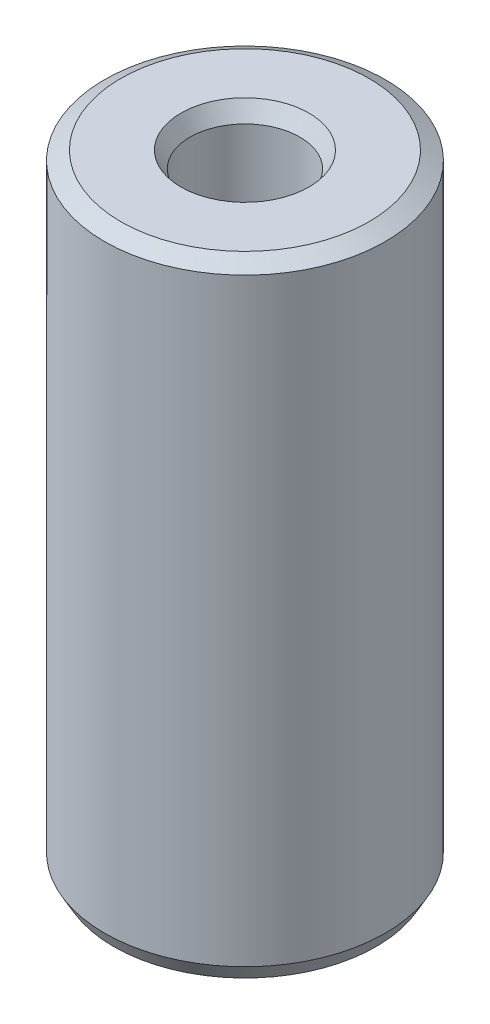
ISO-10303-21;
HEADER;
FILE_DESCRIPTION(('STEP AP214'),'2;1');
FILE_NAME('part.step','',(''),(''),'','','');
FILE_SCHEMA(('AUTOMOTIVE_DESIGN { 1 0 10303 214 1 1 1 1 }'));
ENDSEC;
DATA;
#1=APPLICATION_CONTEXT('core data for automotive mechanical design processes');
#2=APPLICATION_PROTOCOL_DEFINITION('international standard','automotive_design',2000,#1);
#3=PRODUCT_CONTEXT('',#1,'mechanical');
#4=PRODUCT('Part','Part','',(#3));
#5=PRODUCT_RELATED_PRODUCT_CATEGORY('part','',(#4));
#6=PRODUCT_DEFINITION_FORMATION('','',#4);
#7=PRODUCT_DEFINITION_CONTEXT('part definition',#1,'design');
#8=PRODUCT_DEFINITION('design','',#6,#7);
#9=PRODUCT_DEFINITION_SHAPE('','',#8);
#10=(LENGTH_UNIT() NAMED_UNIT(*) SI_UNIT(.MILLI.,.METRE.));
#11=(NAMED_UNIT(*) PLANE_ANGLE_UNIT() SI_UNIT($,.RADIAN.));
#12=(NAMED_UNIT(*) SI_UNIT($,.STERADIAN.) SOLID_ANGLE_UNIT());
#13=UNCERTAINTY_MEASURE_WITH_UNIT(LENGTH_MEASURE(1.E-05),#10,'distance_accuracy_value','');
#14=(GEOMETRIC_REPRESENTATION_CONTEXT(3) GLOBAL_UNCERTAINTY_ASSIGNED_CONTEXT((#13)) GLOBAL_UNIT_ASSIGNED_CONTEXT((#10,
#11,#12)) REPRESENTATION_CONTEXT('',''));
#15=CARTESIAN_POINT('',(0.,0.,0.));
#16=DIRECTION('',(0.,0.,1.));
#17=DIRECTION('',(1.,0.,0.));
#18=AXIS2_PLACEMENT_3D('',#15,#16,#17);
#19=CARTESIAN_POINT('',(0.,100.083481992382,0.));
#20=DIRECTION('',(0.,-1.,0.));
#21=DIRECTION('',(0.,0.,-1.));
#22=AXIS2_PLACEMENT_3D('',#19,#20,#21);
#23=CYLINDRICAL_SURFACE('',#22,22.5);
#24=CARTESIAN_POINT('',(0.,2.60014927891955,0.));
#25=DIRECTION('',(0.,1.,0.));
#26=DIRECTION('',(0.,0.,1.));
#27=AXIS2_PLACEMENT_3D('',#24,#25,#26);
#28=CIRCLE('',#27,22.5);
#29=CARTESIAN_POINT('',(0.,2.60014927891955,22.5));
#30=VERTEX_POINT('',#29);
#31=EDGE_CURVE('E10',#30,#30,#28,.T.);
#32=ORIENTED_EDGE('',*,*,#31,.T.);
#33=EDGE_LOOP('',(#32));
#34=FACE_BOUND('',#33,.T.);
#35=CARTESIAN_POINT('',(0.,98.6213526848225,0.));
#36=DIRECTION('',(0.,1.,0.));
#37=DIRECTION('',(0.,0.,1.));
#38=AXIS2_PLACEMENT_3D('',#35,#36,#37);
#39=CIRCLE('',#38,22.5);
#40=CARTESIAN_POINT('',(0.,98.6213526848225,22.5));
#41=VERTEX_POINT('',#40);
#42=EDGE_CURVE('E50',#41,#41,#39,.F.);
#43=ORIENTED_EDGE('',*,*,#42,.T.);
#44=EDGE_LOOP('',(#43));
#45=FACE_BOUND('',#44,.T.);
#46=ADVANCED_FACE('F39',(#34,#45),#23,.T.);
#47=CARTESIAN_POINT('',(0.,100.083481992382,0.));
#48=DIRECTION('',(0.,1.,0.));
#49=DIRECTION('',(0.,0.,1.));
#50=AXIS2_PLACEMENT_3D('',#47,#48,#49);
#51=PLANE('',#50);
#52=CARTESIAN_POINT('',(0.,100.083481992382,0.));
#53=DIRECTION('',(0.,1.,0.));
#54=DIRECTION('',(0.,0.,1.));
#55=AXIS2_PLACEMENT_3D('',#52,#53,#54);
#56=CIRCLE('',#55,10.2696610250423);
#57=CARTESIAN_POINT('',(0.,100.083481992382,10.2696610250423));
#58=VERTEX_POINT('',#57);
#59=EDGE_CURVE('E58',#58,#58,#56,.F.);
#60=ORIENTED_EDGE('',*,*,#59,.T.);
#61=EDGE_LOOP('',(#60));
#62=FACE_BOUND('',#61,.T.);
#63=CARTESIAN_POINT('',(0.,100.083481992382,0.));
#64=DIRECTION('',(0.,1.,0.));
#65=DIRECTION('',(0.,0.,1.));
#66=AXIS2_PLACEMENT_3D('',#63,#64,#65);
#67=CIRCLE('',#66,19.8998507210804);
#68=CARTESIAN_POINT('',(0.,100.083481992382,19.8998507210804));
#69=VERTEX_POINT('',#68);
#70=EDGE_CURVE('E61',#69,#69,#67,.T.);
#71=ORIENTED_EDGE('',*,*,#70,.T.);
#72=EDGE_LOOP('',(#71));
#73=FACE_BOUND('',#72,.T.);
#74=ADVANCED_FACE('F88',(#62,#73),#51,.T.);
#75=CARTESIAN_POINT('',(0.,0.,0.));
#76=DIRECTION('',(0.,1.,0.));
#77=DIRECTION('',(0.,0.,1.));
#78=AXIS2_PLACEMENT_3D('',#75,#76,#77);
#79=PLANE('',#78);
#80=CARTESIAN_POINT('',(0.,0.,0.));
#81=DIRECTION('',(0.,1.,0.));
#82=DIRECTION('',(0.,0.,1.));
#83=AXIS2_PLACEMENT_3D('',#80,#81,#82);
#84=CIRCLE('',#83,11.4076809964021);
#85=CARTESIAN_POINT('',(0.,0.,11.4076809964021));
#86=VERTEX_POINT('',#85);
#87=EDGE_CURVE('E51',#86,#86,#84,.T.);
#88=ORIENTED_EDGE('',*,*,#87,.T.);
#89=EDGE_LOOP('',(#88));
#90=FACE_BOUND('',#89,.T.);
#91=CARTESIAN_POINT('',(0.,0.,0.));
#92=DIRECTION('',(0.,1.,0.));
#93=DIRECTION('',(0.,0.,1.));
#94=AXIS2_PLACEMENT_3D('',#91,#92,#93);
#95=CIRCLE('',#94,21.0378706924402);
#96=CARTESIAN_POINT('',(0.,0.,21.0378706924402));
#97=VERTEX_POINT('',#96);
#98=EDGE_CURVE('E54',#97,#97,#95,.F.);
#99=ORIENTED_EDGE('',*,*,#98,.T.);
#100=EDGE_LOOP('',(#99));
#101=FACE_BOUND('',#100,.T.);
#102=ADVANCED_FACE('F83',(#90,#101),#79,.F.);
#103=CARTESIAN_POINT('',(0.,100.083481992382,0.));
#104=DIRECTION('',(0.,-1.,0.));
#105=DIRECTION('',(0.,0.,-1.));
#106=AXIS2_PLACEMENT_3D('',#103,#104,#105);
#107=CYLINDRICAL_SURFACE('',#106,8.80753171748253);
#108=CARTESIAN_POINT('',(0.,97.4833327134627,0.));
#109=DIRECTION('',(0.,1.,0.));
#110=DIRECTION('',(0.,0.,1.));
#111=AXIS2_PLACEMENT_3D('',#108,#109,#110);
#112=CIRCLE('',#111,8.80753171748253);
#113=CARTESIAN_POINT('',(0.,97.4833327134627,8.80753171748253));
#114=VERTEX_POINT('',#113);
#115=EDGE_CURVE('E67',#114,#114,#112,.T.);
#116=ORIENTED_EDGE('',*,*,#115,.T.);
#117=EDGE_LOOP('',(#116));
#118=FACE_BOUND('',#117,.T.);
#119=CARTESIAN_POINT('',(0.,1.46212930755979,0.));
#120=DIRECTION('',(0.,1.,0.));
#121=DIRECTION('',(0.,0.,1.));
#122=AXIS2_PLACEMENT_3D('',#119,#120,#121);
#123=CIRCLE('',#122,8.80753171748253);
#124=CARTESIAN_POINT('',(0.,1.46212930755979,8.80753171748253));
#125=VERTEX_POINT('',#124);
#126=EDGE_CURVE('E69',#125,#125,#123,.F.);
#127=ORIENTED_EDGE('',*,*,#126,.T.);
#128=EDGE_LOOP('',(#127));
#129=FACE_BOUND('',#128,.T.);
#130=ADVANCED_FACE('F71',(#118,#129),#107,.F.);
#131=CARTESIAN_POINT('',(0.,97.4833327134627,0.));
#132=DIRECTION('',(0.,1.,0.));
#133=DIRECTION('',(0.,0.,1.));
#134=AXIS2_PLACEMENT_3D('',#131,#132,#133);
#135=CONICAL_SURFACE('',#134,8.80753171748253,0.51225661912964);
#136=ORIENTED_EDGE('',*,*,#59,.F.);
#137=EDGE_LOOP('',(#136));
#138=FACE_BOUND('',#137,.T.);
#139=ORIENTED_EDGE('',*,*,#115,.F.);
#140=EDGE_LOOP('',(#139));
#141=FACE_BOUND('',#140,.T.);
#142=ADVANCED_FACE('F77',(#138,#141),#135,.F.);
#143=CARTESIAN_POINT('',(0.,0.,0.));
#144=DIRECTION('',(0.,-1.,0.));
#145=DIRECTION('',(0.,0.,-1.));
#146=AXIS2_PLACEMENT_3D('',#143,#144,#145);
#147=CONICAL_SURFACE('',#146,11.4076809964021,1.05853970766526);
#148=ORIENTED_EDGE('',*,*,#126,.F.);
#149=EDGE_LOOP('',(#148));
#150=FACE_BOUND('',#149,.T.);
#151=ORIENTED_EDGE('',*,*,#87,.F.);
#152=EDGE_LOOP('',(#151));
#153=FACE_BOUND('',#152,.T.);
#154=ADVANCED_FACE('F73',(#150,#153),#147,.F.);
#155=CARTESIAN_POINT('',(0.,2.60014927891955,0.));
#156=DIRECTION('',(0.,1.,0.));
#157=DIRECTION('',(0.,0.,1.));
#158=AXIS2_PLACEMENT_3D('',#155,#156,#157);
#159=CONICAL_SURFACE('',#158,22.5,0.512256619129643);
#160=CARTESIAN_POINT('',(0.,0.,21.0378706924402));
#161=CARTESIAN_POINT('',(0.,0.0270848883220778,21.0531012060607));
#162=CARTESIAN_POINT('',(0.,0.0541697766441567,21.0683317196811));
#163=CARTESIAN_POINT('',(0.,0.108339553288314,21.0987927469219));
#164=CARTESIAN_POINT('',(0.,0.135424441610393,21.1140232605423));
#165=CARTESIAN_POINT('',(0.,0.18959421825455,21.1444842877831));
#166=CARTESIAN_POINT('',(0.,0.216679106576629,21.1597148014036));
#167=CARTESIAN_POINT('',(0.,0.270848883220786,21.1901758286444));
#168=CARTESIAN_POINT('',(0.,0.297933771542865,21.2054063422648));
#169=CARTESIAN_POINT('',(0.,0.352103548187022,21.2358673695056));
#170=CARTESIAN_POINT('',(0.,0.379188436509101,21.251097883126));
#171=CARTESIAN_POINT('',(0.,0.433358213153258,21.2815589103669));
#172=CARTESIAN_POINT('',(0.,0.460443101475336,21.2967894239873));
#173=CARTESIAN_POINT('',(0.,0.514612878119494,21.3272504512281));
#174=CARTESIAN_POINT('',(0.,0.541697766441573,21.3424809648485));
#175=CARTESIAN_POINT('',(0.,0.59586754308573,21.3729419920894));
#176=CARTESIAN_POINT('',(0.,0.622952431407808,21.3881725057098));
#177=CARTESIAN_POINT('',(0.,0.677122208051966,21.4186335329506));
#178=CARTESIAN_POINT('',(0.,0.704207096374044,21.433864046571));
#179=CARTESIAN_POINT('',(0.,0.758376873018202,21.4643250738118));
#180=CARTESIAN_POINT('',(0.,0.78546176134028,21.4795555874322));
#181=CARTESIAN_POINT('',(0.,0.839631537984437,21.5100166146731));
#182=CARTESIAN_POINT('',(0.,0.866716426306516,21.5252471282935));
#183=CARTESIAN_POINT('',(0.,0.920886202950674,21.5557081555343));
#184=CARTESIAN_POINT('',(0.,0.947971091272752,21.5709386691547));
#185=CARTESIAN_POINT('',(0.,1.00214086791691,21.6013996963956));
#186=CARTESIAN_POINT('',(0.,1.02922575623899,21.616630210016));
#187=CARTESIAN_POINT('',(0.,1.08339553288315,21.6470912372568));
#188=CARTESIAN_POINT('',(0.,1.11048042120522,21.6623217508772));
#189=CARTESIAN_POINT('',(0.,1.16465019784938,21.6927827781181));
#190=CARTESIAN_POINT('',(0.,1.19173508617146,21.7080132917385));
#191=CARTESIAN_POINT('',(0.,1.24590486281562,21.7384743189793));
#192=CARTESIAN_POINT('',(0.,1.2729897511377,21.7537048325997));
#193=CARTESIAN_POINT('',(0.,1.32715952778185,21.7841658598405));
#194=CARTESIAN_POINT('',(0.,1.35424441610393,21.7993963734609));
#195=CARTESIAN_POINT('',(0.,1.40841419274809,21.8298574007018));
#196=CARTESIAN_POINT('',(0.,1.43549908107017,21.8450879143222));
#197=CARTESIAN_POINT('',(0.,1.48966885771433,21.875548941563));
#198=CARTESIAN_POINT('',(0.,1.5167537460364,21.8907794551834));
#199=CARTESIAN_POINT('',(0.,1.57092352268056,21.9212404824243));
#200=CARTESIAN_POINT('',(0.,1.59800841100264,21.9364709960447));
#201=CARTESIAN_POINT('',(0.,1.6521781876468,21.9669320232855));
#202=CARTESIAN_POINT('',(0.,1.67926307596888,21.9821625369059));
#203=CARTESIAN_POINT('',(0.,1.73343285261303,22.0126235641468));
#204=CARTESIAN_POINT('',(0.,1.76051774093511,22.0278540777672));
#205=CARTESIAN_POINT('',(0.,1.81468751757927,22.058315105008));
#206=CARTESIAN_POINT('',(0.,1.84177240590135,22.0735456186284));
#207=CARTESIAN_POINT('',(0.,1.8959421825455,22.1040066458692));
#208=CARTESIAN_POINT('',(0.,1.92302707086758,22.1192371594896));
#209=CARTESIAN_POINT('',(0.,1.97719684751174,22.1496981867305));
#210=CARTESIAN_POINT('',(0.,2.00428173583382,22.1649287003509));
#211=CARTESIAN_POINT('',(0.,2.05845151247798,22.1953897275917));
#212=CARTESIAN_POINT('',(0.,2.08553640080006,22.2106202412121));
#213=CARTESIAN_POINT('',(0.,2.13970617744421,22.241081268453));
#214=CARTESIAN_POINT('',(0.,2.16679106576629,22.2563117820734));
#215=CARTESIAN_POINT('',(0.,2.22096084241045,22.2867728093142));
#216=CARTESIAN_POINT('',(0.,2.24804573073253,22.3020033229346));
#217=CARTESIAN_POINT('',(0.,2.30221550737668,22.3324643501754));
#218=CARTESIAN_POINT('',(0.,2.32930039569876,22.3476948637959));
#219=CARTESIAN_POINT('',(0.,2.38347017234292,22.3781558910367));
#220=CARTESIAN_POINT('',(0.,2.410555060665,22.3933864046571));
#221=CARTESIAN_POINT('',(0.,2.46472483730916,22.4238474318979));
#222=CARTESIAN_POINT('',(0.,2.49180972563124,22.4390779455183));
#223=CARTESIAN_POINT('',(0.,2.54597950227539,22.4695389727592));
#224=CARTESIAN_POINT('',(0.,2.57306439059747,22.4847694863796));
#225=CARTESIAN_POINT('',(0.,2.60014927891955,22.5));
#226=B_SPLINE_CURVE_WITH_KNOTS('',3,(#160,#161,#162,#163,#164,#165,#166,#167,#168,#169,#170,
#171,#172,#173,#174,#175,#176,#177,#178,#179,#180,#181,#182,#183,#184,#185,#186,#187,#188,#189,
#190,#191,#192,#193,#194,#195,#196,#197,#198,#199,#200,#201,#202,#203,#204,#205,#206,#207,#208,
#209,#210,#211,#212,#213,#214,#215,#216,#217,#218,#219,#220,#221,#222,#223,#224,#225),
.UNSPECIFIED.,.F.,.F.,(4,2,2,2,2,2,2,2,2,2,2,2,2,2,2,2,2,2,2,2,2,2,2,2,2,2,2,2,2,2,2,2,4),(0.,
0.0932203705476961,0.186440741095392,0.27966111164309,0.372881482190786,0.466101852738482,
0.55932222328618,0.652542593833876,0.745762964381572,0.838983334929268,0.932203705476966,
1.02542407602466,1.11864444657236,1.21186481712006,1.30508518766775,1.39830555821545,
1.49152592876314,1.58474629931084,1.67796666985854,1.77118704040623,1.86440741095393,
1.95762778150163,2.05084815204932,2.14406852259702,2.23728889314472,2.33050926369241,
2.42372963424011,2.51695000478781,2.6101703753355,2.7033907458832,2.7966111164309,
2.88983148697859,2.98305185752629),.UNSPECIFIED.);
#227=EDGE_CURVE('BSEAM76',#97,#30,#226,.T.);
#228=ORIENTED_EDGE('',*,*,#98,.F.);
#229=ORIENTED_EDGE('',*,*,#31,.F.);
#230=ORIENTED_EDGE('',*,*,#227,.T.);
#231=ORIENTED_EDGE('',*,*,#227,.F.);
#232=EDGE_LOOP('',(#228,#230,#229,#231));
#233=FACE_BOUND('',#232,.T.);
#234=ADVANCED_FACE('F76',(#233),#159,.T.);
#235=CARTESIAN_POINT('',(0.,100.083481992382,0.));
#236=DIRECTION('',(0.,-1.,0.));
#237=DIRECTION('',(0.,0.,-1.));
#238=AXIS2_PLACEMENT_3D('',#235,#236,#237);
#239=CONICAL_SURFACE('',#238,19.8998507210804,1.05853970766525);
#240=ORIENTED_EDGE('',*,*,#42,.F.);
#241=EDGE_LOOP('',(#240));
#242=FACE_BOUND('',#241,.T.);
#243=ORIENTED_EDGE('',*,*,#70,.F.);
#244=EDGE_LOOP('',(#243));
#245=FACE_BOUND('',#244,.T.);
#246=ADVANCED_FACE('F45',(#242,#245),#239,.T.);
#247=CLOSED_SHELL('',(#46,#74,#102,#130,#142,#154,#234,#246));
#248=MANIFOLD_SOLID_BREP('B2',#247);
#249=ADVANCED_BREP_SHAPE_REPRESENTATION('',(#18,#248),#14);
#250=SHAPE_DEFINITION_REPRESENTATION(#9,#249);
ENDSEC;
END-ISO-10303-21;
